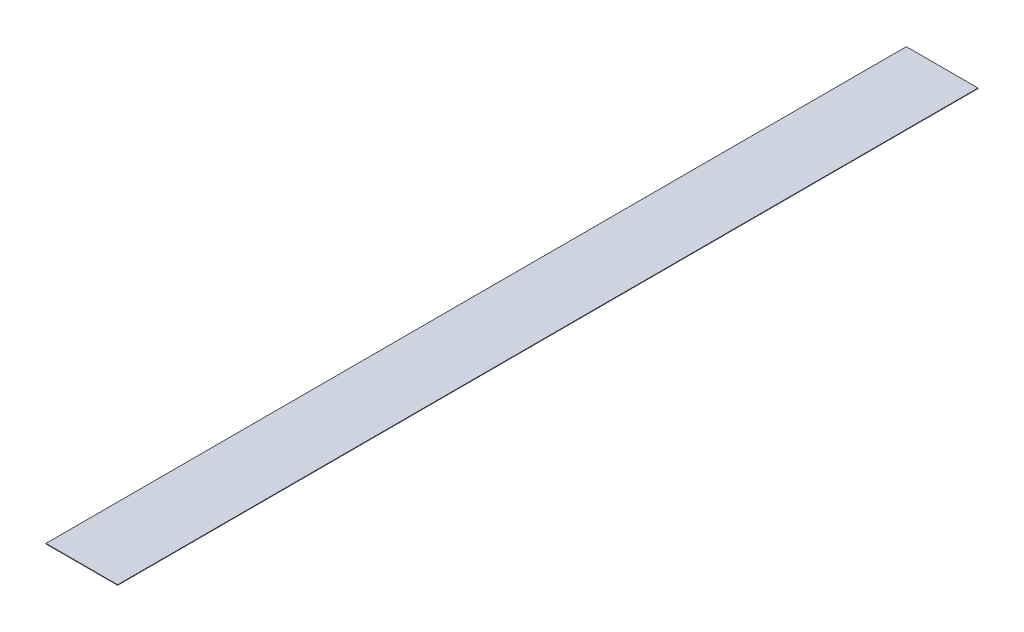
ISO-10303-21;
HEADER;
FILE_DESCRIPTION(('STEP AP214'),'2;1');
FILE_NAME('part.step','',(''),(''),'','','');
FILE_SCHEMA(('AUTOMOTIVE_DESIGN { 1 0 10303 214 1 1 1 1 }'));
ENDSEC;
DATA;
#1=APPLICATION_CONTEXT('core data for automotive mechanical design processes');
#2=APPLICATION_PROTOCOL_DEFINITION('international standard','automotive_design',2000,#1);
#3=PRODUCT_CONTEXT('',#1,'mechanical');
#4=PRODUCT('Part','Part','',(#3));
#5=PRODUCT_RELATED_PRODUCT_CATEGORY('part','',(#4));
#6=PRODUCT_DEFINITION_FORMATION('','',#4);
#7=PRODUCT_DEFINITION_CONTEXT('part definition',#1,'design');
#8=PRODUCT_DEFINITION('design','',#6,#7);
#9=PRODUCT_DEFINITION_SHAPE('','',#8);
#10=(LENGTH_UNIT() NAMED_UNIT(*) SI_UNIT(.MILLI.,.METRE.));
#11=(NAMED_UNIT(*) PLANE_ANGLE_UNIT() SI_UNIT($,.RADIAN.));
#12=(NAMED_UNIT(*) SI_UNIT($,.STERADIAN.) SOLID_ANGLE_UNIT());
#13=UNCERTAINTY_MEASURE_WITH_UNIT(LENGTH_MEASURE(1.E-05),#10,'distance_accuracy_value','');
#14=(GEOMETRIC_REPRESENTATION_CONTEXT(3) GLOBAL_UNCERTAINTY_ASSIGNED_CONTEXT((#13)) GLOBAL_UNIT_ASSIGNED_CONTEXT((#10,
#11,#12)) REPRESENTATION_CONTEXT('',''));
#15=CARTESIAN_POINT('',(0.,0.,0.));
#16=DIRECTION('',(0.,0.,1.));
#17=DIRECTION('',(1.,0.,0.));
#18=AXIS2_PLACEMENT_3D('',#15,#16,#17);
#19=CARTESIAN_POINT('',(-12.45,0.175,-149.5));
#20=DIRECTION('',(1.,0.,0.));
#21=DIRECTION('',(0.,0.,-1.));
#22=AXIS2_PLACEMENT_3D('',#19,#20,#21);
#23=PLANE('',#22);
#24=DIRECTION('',(0.,0.,1.));
#25=VECTOR('',#24,1.);
#26=CARTESIAN_POINT('',(-12.45,0.,-149.5));
#27=LINE('',#26,#25);
#28=CARTESIAN_POINT('',(-12.45,0.,-149.5));
#29=VERTEX_POINT('',#28);
#30=CARTESIAN_POINT('',(-12.45,0.,149.5));
#31=VERTEX_POINT('',#30);
#32=EDGE_CURVE('E96',#29,#31,#27,.T.);
#33=ORIENTED_EDGE('',*,*,#32,.T.);
#34=DIRECTION('',(0.,-1.,0.));
#35=VECTOR('',#34,1.);
#36=CARTESIAN_POINT('',(-12.45,0.175,149.5));
#37=LINE('',#36,#35);
#38=CARTESIAN_POINT('',(-12.45,0.175,149.5));
#39=VERTEX_POINT('',#38);
#40=EDGE_CURVE('E11',#39,#31,#37,.T.);
#41=ORIENTED_EDGE('',*,*,#40,.F.);
#42=DIRECTION('',(0.,0.,1.));
#43=VECTOR('',#42,1.);
#44=CARTESIAN_POINT('',(-12.45,0.175,-149.5));
#45=LINE('',#44,#43);
#46=CARTESIAN_POINT('',(-12.45,0.175,-149.5));
#47=VERTEX_POINT('',#46);
#48=EDGE_CURVE('E84',#47,#39,#45,.T.);
#49=ORIENTED_EDGE('',*,*,#48,.F.);
#50=DIRECTION('',(0.,-1.,0.));
#51=VECTOR('',#50,1.);
#52=CARTESIAN_POINT('',(-12.45,0.175,-149.5));
#53=LINE('',#52,#51);
#54=EDGE_CURVE('E92',#47,#29,#53,.T.);
#55=ORIENTED_EDGE('',*,*,#54,.T.);
#56=EDGE_LOOP('',(#33,#41,#49,#55));
#57=FACE_BOUND('',#56,.T.);
#58=ADVANCED_FACE('F33',(#57),#23,.F.);
#59=CARTESIAN_POINT('',(-12.45,0.175,149.5));
#60=DIRECTION('',(0.,0.,-1.));
#61=DIRECTION('',(-1.,0.,0.));
#62=AXIS2_PLACEMENT_3D('',#59,#60,#61);
#63=PLANE('',#62);
#64=DIRECTION('',(1.,0.,0.));
#65=VECTOR('',#64,1.);
#66=CARTESIAN_POINT('',(-12.45,0.,149.5));
#67=LINE('',#66,#65);
#68=CARTESIAN_POINT('',(12.45,0.,149.5));
#69=VERTEX_POINT('',#68);
#70=EDGE_CURVE('E88',#31,#69,#67,.T.);
#71=ORIENTED_EDGE('',*,*,#70,.T.);
#72=DIRECTION('',(0.,-1.,0.));
#73=VECTOR('',#72,1.);
#74=CARTESIAN_POINT('',(12.45,0.175,149.5));
#75=LINE('',#74,#73);
#76=CARTESIAN_POINT('',(12.45,0.175,149.5));
#77=VERTEX_POINT('',#76);
#78=EDGE_CURVE('E41',#77,#69,#75,.T.);
#79=ORIENTED_EDGE('',*,*,#78,.F.);
#80=DIRECTION('',(1.,0.,0.));
#81=VECTOR('',#80,1.);
#82=CARTESIAN_POINT('',(-12.45,0.175,149.5));
#83=LINE('',#82,#81);
#84=EDGE_CURVE('E79',#39,#77,#83,.T.);
#85=ORIENTED_EDGE('',*,*,#84,.F.);
#86=ORIENTED_EDGE('',*,*,#40,.T.);
#87=EDGE_LOOP('',(#71,#79,#85,#86));
#88=FACE_BOUND('',#87,.T.);
#89=ADVANCED_FACE('F87',(#88),#63,.F.);
#90=CARTESIAN_POINT('',(12.45,0.175,-149.5));
#91=DIRECTION('',(-1.,0.,0.));
#92=DIRECTION('',(0.,0.,1.));
#93=AXIS2_PLACEMENT_3D('',#90,#91,#92);
#94=PLANE('',#93);
#95=DIRECTION('',(0.,0.,-1.));
#96=VECTOR('',#95,1.);
#97=CARTESIAN_POINT('',(12.45,0.,-149.5));
#98=LINE('',#97,#96);
#99=CARTESIAN_POINT('',(12.45,0.,-149.5));
#100=VERTEX_POINT('',#99);
#101=EDGE_CURVE('E66',#69,#100,#98,.T.);
#102=ORIENTED_EDGE('',*,*,#101,.T.);
#103=DIRECTION('',(0.,-1.,0.));
#104=VECTOR('',#103,1.);
#105=CARTESIAN_POINT('',(12.45,0.175,-149.5));
#106=LINE('',#105,#104);
#107=CARTESIAN_POINT('',(12.45,0.175,-149.5));
#108=VERTEX_POINT('',#107);
#109=EDGE_CURVE('E89',#108,#100,#106,.T.);
#110=ORIENTED_EDGE('',*,*,#109,.F.);
#111=DIRECTION('',(0.,0.,-1.));
#112=VECTOR('',#111,1.);
#113=CARTESIAN_POINT('',(12.45,0.175,-149.5));
#114=LINE('',#113,#112);
#115=EDGE_CURVE('E82',#77,#108,#114,.T.);
#116=ORIENTED_EDGE('',*,*,#115,.F.);
#117=ORIENTED_EDGE('',*,*,#78,.T.);
#118=EDGE_LOOP('',(#102,#110,#116,#117));
#119=FACE_BOUND('',#118,.T.);
#120=ADVANCED_FACE('F90',(#119),#94,.F.);
#121=CARTESIAN_POINT('',(-12.45,0.175,-149.5));
#122=DIRECTION('',(0.,0.,1.));
#123=DIRECTION('',(1.,0.,0.));
#124=AXIS2_PLACEMENT_3D('',#121,#122,#123);
#125=PLANE('',#124);
#126=DIRECTION('',(-1.,0.,0.));
#127=VECTOR('',#126,1.);
#128=CARTESIAN_POINT('',(-12.45,0.,-149.5));
#129=LINE('',#128,#127);
#130=EDGE_CURVE('E72',#100,#29,#129,.T.);
#131=ORIENTED_EDGE('',*,*,#130,.T.);
#132=ORIENTED_EDGE('',*,*,#54,.F.);
#133=DIRECTION('',(-1.,0.,0.));
#134=VECTOR('',#133,1.);
#135=CARTESIAN_POINT('',(-12.45,0.175,-149.5));
#136=LINE('',#135,#134);
#137=EDGE_CURVE('E49',#108,#47,#136,.T.);
#138=ORIENTED_EDGE('',*,*,#137,.F.);
#139=ORIENTED_EDGE('',*,*,#109,.T.);
#140=EDGE_LOOP('',(#131,#132,#138,#139));
#141=FACE_BOUND('',#140,.T.);
#142=ADVANCED_FACE('F103',(#141),#125,.F.);
#143=CARTESIAN_POINT('',(-12.45,0.175,149.5));
#144=DIRECTION('',(0.,1.,0.));
#145=DIRECTION('',(0.,0.,1.));
#146=AXIS2_PLACEMENT_3D('',#143,#144,#145);
#147=PLANE('',#146);
#148=ORIENTED_EDGE('',*,*,#48,.T.);
#149=ORIENTED_EDGE('',*,*,#84,.T.);
#150=ORIENTED_EDGE('',*,*,#115,.T.);
#151=ORIENTED_EDGE('',*,*,#137,.T.);
#152=EDGE_LOOP('',(#148,#149,#150,#151));
#153=FACE_BOUND('',#152,.T.);
#154=ADVANCED_FACE('F80',(#153),#147,.T.);
#155=CARTESIAN_POINT('',(-12.45,0.,149.5));
#156=DIRECTION('',(0.,1.,0.));
#157=DIRECTION('',(0.,0.,1.));
#158=AXIS2_PLACEMENT_3D('',#155,#156,#157);
#159=PLANE('',#158);
#160=ORIENTED_EDGE('',*,*,#32,.F.);
#161=ORIENTED_EDGE('',*,*,#130,.F.);
#162=ORIENTED_EDGE('',*,*,#101,.F.);
#163=ORIENTED_EDGE('',*,*,#70,.F.);
#164=EDGE_LOOP('',(#160,#161,#162,#163));
#165=FACE_BOUND('',#164,.T.);
#166=ADVANCED_FACE('F106',(#165),#159,.F.);
#167=CLOSED_SHELL('',(#58,#89,#120,#142,#154,#166));
#168=MANIFOLD_SOLID_BREP('B2',#167);
#169=ADVANCED_BREP_SHAPE_REPRESENTATION('',(#18,#168),#14);
#170=SHAPE_DEFINITION_REPRESENTATION(#9,#169);
ENDSEC;
END-ISO-10303-21;
